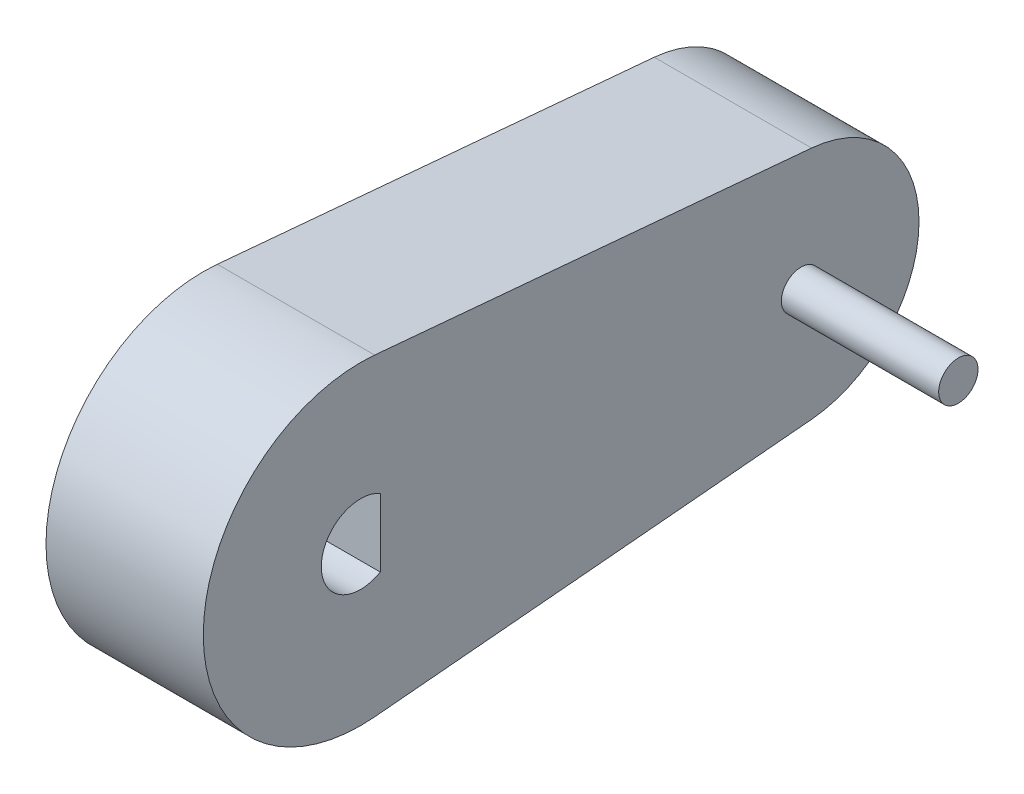
ISO-10303-21;
HEADER;
FILE_DESCRIPTION(('STEP AP214'),'2;1');
FILE_NAME('part.step','',(''),(''),'','','');
FILE_SCHEMA(('AUTOMOTIVE_DESIGN { 1 0 10303 214 1 1 1 1 }'));
ENDSEC;
DATA;
#1=APPLICATION_CONTEXT('core data for automotive mechanical design processes');
#2=APPLICATION_PROTOCOL_DEFINITION('international standard','automotive_design',2000,#1);
#3=PRODUCT_CONTEXT('',#1,'mechanical');
#4=PRODUCT('Part','Part','',(#3));
#5=PRODUCT_RELATED_PRODUCT_CATEGORY('part','',(#4));
#6=PRODUCT_DEFINITION_FORMATION('','',#4);
#7=PRODUCT_DEFINITION_CONTEXT('part definition',#1,'design');
#8=PRODUCT_DEFINITION('design','',#6,#7);
#9=PRODUCT_DEFINITION_SHAPE('','',#8);
#10=(LENGTH_UNIT() NAMED_UNIT(*) SI_UNIT(.MILLI.,.METRE.));
#11=(NAMED_UNIT(*) PLANE_ANGLE_UNIT() SI_UNIT($,.RADIAN.));
#12=(NAMED_UNIT(*) SI_UNIT($,.STERADIAN.) SOLID_ANGLE_UNIT());
#13=UNCERTAINTY_MEASURE_WITH_UNIT(LENGTH_MEASURE(1.E-05),#10,'distance_accuracy_value','');
#14=(GEOMETRIC_REPRESENTATION_CONTEXT(3) GLOBAL_UNCERTAINTY_ASSIGNED_CONTEXT((#13)) GLOBAL_UNIT_ASSIGNED_CONTEXT((#10,
#11,#12)) REPRESENTATION_CONTEXT('',''));
#15=CARTESIAN_POINT('',(0.,0.,0.));
#16=DIRECTION('',(0.,0.,1.));
#17=DIRECTION('',(1.,0.,0.));
#18=AXIS2_PLACEMENT_3D('',#15,#16,#17);
#19=CARTESIAN_POINT('',(50.8,0.,0.));
#20=DIRECTION('',(1.,0.,0.));
#21=DIRECTION('',(0.,0.,-1.));
#22=AXIS2_PLACEMENT_3D('',#19,#20,#21);
#23=PLANE('',#22);
#24=CARTESIAN_POINT('',(50.8,0.,-142.24));
#25=DIRECTION('',(1.,0.,0.));
#26=DIRECTION('',(0.,0.,-1.));
#27=AXIS2_PLACEMENT_3D('',#24,#25,#26);
#28=CIRCLE('',#27,6.35);
#29=CARTESIAN_POINT('',(50.8,0.,-148.59));
#30=VERTEX_POINT('',#29);
#31=EDGE_CURVE('E99',#30,#30,#28,.T.);
#32=ORIENTED_EDGE('',*,*,#31,.F.);
#33=EDGE_LOOP('',(#32));
#34=FACE_BOUND('',#33,.T.);
#35=CARTESIAN_POINT('',(50.8,0.,0.));
#36=DIRECTION('',(1.,0.,0.));
#37=DIRECTION('',(0.,0.,-1.));
#38=AXIS2_PLACEMENT_3D('',#35,#36,#37);
#39=CIRCLE('',#38,50.8);
#40=CARTESIAN_POINT('',(50.8,50.5971075845089,-4.53571428571429));
#41=VERTEX_POINT('',#40);
#42=CARTESIAN_POINT('',(50.8,-50.5971075845089,-4.53571428571429));
#43=VERTEX_POINT('',#42);
#44=EDGE_CURVE('E106',#41,#43,#39,.T.);
#45=ORIENTED_EDGE('',*,*,#44,.T.);
#46=DIRECTION('',(0.,0.0892857142857142,-0.996006054813167));
#47=VECTOR('',#46,1.);
#48=CARTESIAN_POINT('',(50.8,-50.5971075845089,-4.53571428571429));
#49=LINE('',#48,#47);
#50=CARTESIAN_POINT('',(50.8,-37.9478306883817,-145.641785714286));
#51=VERTEX_POINT('',#50);
#52=EDGE_CURVE('E109',#43,#51,#49,.T.);
#53=ORIENTED_EDGE('',*,*,#52,.T.);
#54=CARTESIAN_POINT('',(50.8,0.,-142.24));
#55=DIRECTION('',(1.,0.,0.));
#56=DIRECTION('',(0.,0.,-1.));
#57=AXIS2_PLACEMENT_3D('',#54,#55,#56);
#58=CIRCLE('',#57,38.1);
#59=CARTESIAN_POINT('',(50.8,37.9478306883817,-145.641785714286));
#60=VERTEX_POINT('',#59);
#61=EDGE_CURVE('E112',#51,#60,#58,.T.);
#62=ORIENTED_EDGE('',*,*,#61,.T.);
#63=DIRECTION('',(0.,0.0892857142857143,0.996006054813167));
#64=VECTOR('',#63,1.);
#65=CARTESIAN_POINT('',(50.8,50.5971075845089,-4.53571428571429));
#66=LINE('',#65,#64);
#67=EDGE_CURVE('E114',#60,#41,#66,.T.);
#68=ORIENTED_EDGE('',*,*,#67,.T.);
#69=EDGE_LOOP('',(#45,#53,#62,#68));
#70=FACE_BOUND('',#69,.T.);
#71=DIRECTION('',(0.,1.,0.));
#72=VECTOR('',#71,1.);
#73=CARTESIAN_POINT('',(50.8,10.9985226280624,-6.35));
#74=LINE('',#73,#72);
#75=CARTESIAN_POINT('',(50.8,-10.9985226280624,-6.35));
#76=VERTEX_POINT('',#75);
#77=CARTESIAN_POINT('',(50.8,10.9985226280624,-6.35));
#78=VERTEX_POINT('',#77);
#79=EDGE_CURVE('E85',#76,#78,#74,.T.);
#80=ORIENTED_EDGE('',*,*,#79,.F.);
#81=CARTESIAN_POINT('',(50.8,0.,0.));
#82=DIRECTION('',(1.,0.,0.));
#83=DIRECTION('',(0.,0.,-1.));
#84=AXIS2_PLACEMENT_3D('',#81,#82,#83);
#85=CIRCLE('',#84,12.7);
#86=EDGE_CURVE('E91',#78,#76,#85,.T.);
#87=ORIENTED_EDGE('',*,*,#86,.F.);
#88=EDGE_LOOP('',(#80,#87));
#89=FACE_BOUND('',#88,.T.);
#90=ADVANCED_FACE('F33',(#34,#70,#89),#23,.T.);
#91=CARTESIAN_POINT('',(0.,0.,0.));
#92=DIRECTION('',(1.,0.,0.));
#93=DIRECTION('',(0.,0.,-1.));
#94=AXIS2_PLACEMENT_3D('',#91,#92,#93);
#95=PLANE('',#94);
#96=CARTESIAN_POINT('',(0.,0.,0.));
#97=DIRECTION('',(1.,0.,0.));
#98=DIRECTION('',(0.,0.,-1.));
#99=AXIS2_PLACEMENT_3D('',#96,#97,#98);
#100=CIRCLE('',#99,50.8);
#101=CARTESIAN_POINT('',(0.,50.5971075845089,-4.53571428571429));
#102=VERTEX_POINT('',#101);
#103=CARTESIAN_POINT('',(0.,-50.5971075845089,-4.53571428571429));
#104=VERTEX_POINT('',#103);
#105=EDGE_CURVE('E105',#102,#104,#100,.T.);
#106=ORIENTED_EDGE('',*,*,#105,.F.);
#107=DIRECTION('',(0.,0.0892857142857143,0.996006054813167));
#108=VECTOR('',#107,1.);
#109=CARTESIAN_POINT('',(0.,50.5971075845089,-4.53571428571429));
#110=LINE('',#109,#108);
#111=CARTESIAN_POINT('',(0.,37.9478306883817,-145.641785714286));
#112=VERTEX_POINT('',#111);
#113=EDGE_CURVE('E110',#112,#102,#110,.T.);
#114=ORIENTED_EDGE('',*,*,#113,.F.);
#115=CARTESIAN_POINT('',(0.,0.,-142.24));
#116=DIRECTION('',(1.,0.,0.));
#117=DIRECTION('',(0.,0.,-1.));
#118=AXIS2_PLACEMENT_3D('',#115,#116,#117);
#119=CIRCLE('',#118,38.1);
#120=CARTESIAN_POINT('',(0.,-37.9478306883817,-145.641785714286));
#121=VERTEX_POINT('',#120);
#122=EDGE_CURVE('E121',#121,#112,#119,.T.);
#123=ORIENTED_EDGE('',*,*,#122,.F.);
#124=DIRECTION('',(0.,0.0892857142857142,-0.996006054813167));
#125=VECTOR('',#124,1.);
#126=CARTESIAN_POINT('',(0.,-50.5971075845089,-4.53571428571429));
#127=LINE('',#126,#125);
#128=EDGE_CURVE('E119',#104,#121,#127,.T.);
#129=ORIENTED_EDGE('',*,*,#128,.F.);
#130=EDGE_LOOP('',(#106,#114,#123,#129));
#131=FACE_BOUND('',#130,.T.);
#132=CARTESIAN_POINT('',(0.,0.,0.));
#133=DIRECTION('',(1.,0.,0.));
#134=DIRECTION('',(0.,0.,-1.));
#135=AXIS2_PLACEMENT_3D('',#132,#133,#134);
#136=CIRCLE('',#135,12.7);
#137=CARTESIAN_POINT('',(0.,10.9985226280624,-6.35));
#138=VERTEX_POINT('',#137);
#139=CARTESIAN_POINT('',(0.,-10.9985226280624,-6.35));
#140=VERTEX_POINT('',#139);
#141=EDGE_CURVE('E55',#138,#140,#136,.T.);
#142=ORIENTED_EDGE('',*,*,#141,.T.);
#143=DIRECTION('',(0.,1.,0.));
#144=VECTOR('',#143,1.);
#145=CARTESIAN_POINT('',(0.,10.9985226280624,-6.35));
#146=LINE('',#145,#144);
#147=EDGE_CURVE('E95',#140,#138,#146,.T.);
#148=ORIENTED_EDGE('',*,*,#147,.T.);
#149=EDGE_LOOP('',(#142,#148));
#150=FACE_BOUND('',#149,.T.);
#151=ADVANCED_FACE('F139',(#131,#150),#95,.F.);
#152=CARTESIAN_POINT('',(50.8,0.,0.));
#153=DIRECTION('',(-1.,0.,0.));
#154=DIRECTION('',(0.,0.,1.));
#155=AXIS2_PLACEMENT_3D('',#152,#153,#154);
#156=CYLINDRICAL_SURFACE('',#155,50.8);
#157=ORIENTED_EDGE('',*,*,#105,.T.);
#158=DIRECTION('',(-1.,0.,0.));
#159=VECTOR('',#158,1.);
#160=CARTESIAN_POINT('',(50.8,-50.5971075845089,-4.53571428571429));
#161=LINE('',#160,#159);
#162=EDGE_CURVE('E11',#43,#104,#161,.T.);
#163=ORIENTED_EDGE('',*,*,#162,.F.);
#164=ORIENTED_EDGE('',*,*,#44,.F.);
#165=DIRECTION('',(-1.,0.,0.));
#166=VECTOR('',#165,1.);
#167=CARTESIAN_POINT('',(50.8,50.5971075845089,-4.53571428571429));
#168=LINE('',#167,#166);
#169=EDGE_CURVE('E116',#41,#102,#168,.T.);
#170=ORIENTED_EDGE('',*,*,#169,.T.);
#171=EDGE_LOOP('',(#157,#163,#164,#170));
#172=FACE_BOUND('',#171,.T.);
#173=ADVANCED_FACE('F35',(#172),#156,.T.);
#174=CARTESIAN_POINT('',(50.8,-50.5971075845089,-4.53571428571429));
#175=DIRECTION('',(0.,0.996006054813167,0.0892857142857142));
#176=DIRECTION('',(0.,-0.0892857142857142,0.996006054813167));
#177=AXIS2_PLACEMENT_3D('',#174,#175,#176);
#178=PLANE('',#177);
#179=ORIENTED_EDGE('',*,*,#128,.T.);
#180=DIRECTION('',(-1.,0.,0.));
#181=VECTOR('',#180,1.);
#182=CARTESIAN_POINT('',(50.8,-37.9478306883817,-145.641785714286));
#183=LINE('',#182,#181);
#184=EDGE_CURVE('E41',#51,#121,#183,.T.);
#185=ORIENTED_EDGE('',*,*,#184,.F.);
#186=ORIENTED_EDGE('',*,*,#52,.F.);
#187=ORIENTED_EDGE('',*,*,#162,.T.);
#188=EDGE_LOOP('',(#179,#185,#186,#187));
#189=FACE_BOUND('',#188,.T.);
#190=ADVANCED_FACE('F149',(#189),#178,.F.);
#191=CARTESIAN_POINT('',(50.8,0.,-142.24));
#192=DIRECTION('',(-1.,0.,0.));
#193=DIRECTION('',(0.,0.,1.));
#194=AXIS2_PLACEMENT_3D('',#191,#192,#193);
#195=CYLINDRICAL_SURFACE('',#194,38.1);
#196=ORIENTED_EDGE('',*,*,#122,.T.);
#197=DIRECTION('',(-1.,0.,0.));
#198=VECTOR('',#197,1.);
#199=CARTESIAN_POINT('',(50.8,37.9478306883817,-145.641785714286));
#200=LINE('',#199,#198);
#201=EDGE_CURVE('E126',#60,#112,#200,.T.);
#202=ORIENTED_EDGE('',*,*,#201,.F.);
#203=ORIENTED_EDGE('',*,*,#61,.F.);
#204=ORIENTED_EDGE('',*,*,#184,.T.);
#205=EDGE_LOOP('',(#196,#202,#203,#204));
#206=FACE_BOUND('',#205,.T.);
#207=ADVANCED_FACE('F133',(#206),#195,.T.);
#208=CARTESIAN_POINT('',(50.8,50.5971075845089,-4.53571428571429));
#209=DIRECTION('',(0.,-0.996006054813167,0.0892857142857143));
#210=DIRECTION('',(0.,-0.0892857142857143,-0.996006054813167));
#211=AXIS2_PLACEMENT_3D('',#208,#209,#210);
#212=PLANE('',#211);
#213=ORIENTED_EDGE('',*,*,#113,.T.);
#214=ORIENTED_EDGE('',*,*,#169,.F.);
#215=ORIENTED_EDGE('',*,*,#67,.F.);
#216=ORIENTED_EDGE('',*,*,#201,.T.);
#217=EDGE_LOOP('',(#213,#214,#215,#216));
#218=FACE_BOUND('',#217,.T.);
#219=ADVANCED_FACE('F143',(#218),#212,.F.);
#220=CARTESIAN_POINT('',(50.8,0.,0.));
#221=DIRECTION('',(-1.,0.,0.));
#222=DIRECTION('',(0.,0.,1.));
#223=AXIS2_PLACEMENT_3D('',#220,#221,#222);
#224=CYLINDRICAL_SURFACE('',#223,12.7);
#225=ORIENTED_EDGE('',*,*,#141,.F.);
#226=DIRECTION('',(-1.,0.,0.));
#227=VECTOR('',#226,1.);
#228=CARTESIAN_POINT('',(50.8,10.9985226280624,-6.35));
#229=LINE('',#228,#227);
#230=EDGE_CURVE('E87',#78,#138,#229,.T.);
#231=ORIENTED_EDGE('',*,*,#230,.F.);
#232=ORIENTED_EDGE('',*,*,#86,.T.);
#233=DIRECTION('',(-1.,0.,0.));
#234=VECTOR('',#233,1.);
#235=CARTESIAN_POINT('',(50.8,-10.9985226280624,-6.35));
#236=LINE('',#235,#234);
#237=EDGE_CURVE('E48',#76,#140,#236,.T.);
#238=ORIENTED_EDGE('',*,*,#237,.T.);
#239=EDGE_LOOP('',(#225,#231,#232,#238));
#240=FACE_BOUND('',#239,.T.);
#241=ADVANCED_FACE('F93',(#240),#224,.F.);
#242=CARTESIAN_POINT('',(50.8,10.9985226280624,-6.35));
#243=DIRECTION('',(0.,0.,1.));
#244=DIRECTION('',(1.,0.,0.));
#245=AXIS2_PLACEMENT_3D('',#242,#243,#244);
#246=PLANE('',#245);
#247=ORIENTED_EDGE('',*,*,#147,.F.);
#248=ORIENTED_EDGE('',*,*,#237,.F.);
#249=ORIENTED_EDGE('',*,*,#79,.T.);
#250=ORIENTED_EDGE('',*,*,#230,.T.);
#251=EDGE_LOOP('',(#247,#248,#249,#250));
#252=FACE_BOUND('',#251,.T.);
#253=ADVANCED_FACE('F86',(#252),#246,.T.);
#254=CARTESIAN_POINT('',(101.6,0.,-142.24));
#255=DIRECTION('',(-1.,0.,0.));
#256=DIRECTION('',(0.,0.,1.));
#257=AXIS2_PLACEMENT_3D('',#254,#255,#256);
#258=CYLINDRICAL_SURFACE('',#257,6.35);
#259=CARTESIAN_POINT('',(101.6,0.,-142.24));
#260=DIRECTION('',(1.,0.,0.));
#261=DIRECTION('',(0.,0.,-1.));
#262=AXIS2_PLACEMENT_3D('',#259,#260,#261);
#263=CIRCLE('',#262,6.35);
#264=CARTESIAN_POINT('',(101.6,0.,-148.59));
#265=VERTEX_POINT('',#264);
#266=EDGE_CURVE('E102',#265,#265,#263,.T.);
#267=ORIENTED_EDGE('',*,*,#266,.F.);
#268=EDGE_LOOP('',(#267));
#269=FACE_BOUND('',#268,.T.);
#270=ORIENTED_EDGE('',*,*,#31,.T.);
#271=EDGE_LOOP('',(#270));
#272=FACE_BOUND('',#271,.T.);
#273=ADVANCED_FACE('F174',(#269,#272),#258,.T.);
#274=CARTESIAN_POINT('',(101.6,0.,-142.24));
#275=DIRECTION('',(1.,0.,0.));
#276=DIRECTION('',(0.,0.,-1.));
#277=AXIS2_PLACEMENT_3D('',#274,#275,#276);
#278=PLANE('',#277);
#279=ORIENTED_EDGE('',*,*,#266,.T.);
#280=EDGE_LOOP('',(#279));
#281=FACE_BOUND('',#280,.T.);
#282=ADVANCED_FACE('F178',(#281),#278,.T.);
#283=CLOSED_SHELL('',(#90,#151,#173,#190,#207,#219,#241,#253,#273,#282));
#284=MANIFOLD_SOLID_BREP('B2',#283);
#285=ADVANCED_BREP_SHAPE_REPRESENTATION('',(#18,#284),#14);
#286=SHAPE_DEFINITION_REPRESENTATION(#9,#285);
ENDSEC;
END-ISO-10303-21;
